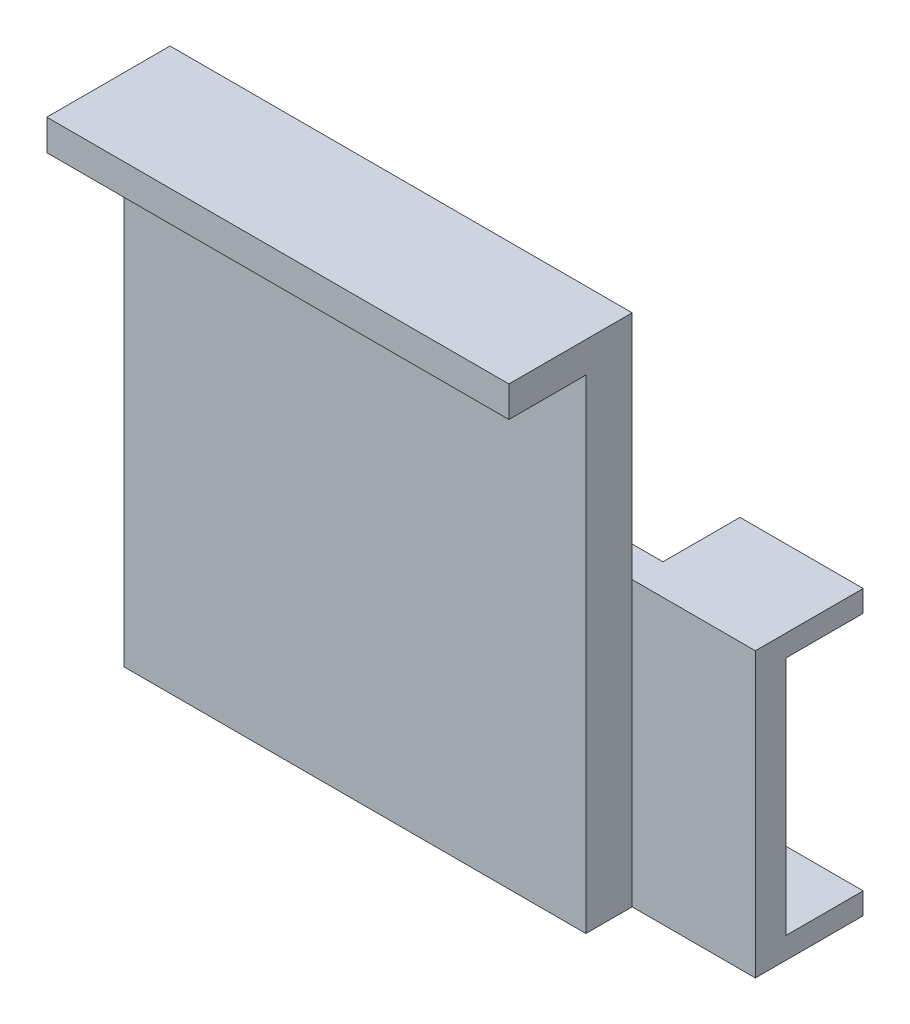
ISO-10303-21;
HEADER;
FILE_DESCRIPTION(('STEP AP214'),'2;1');
FILE_NAME('part.step','',(''),(''),'','','');
FILE_SCHEMA(('AUTOMOTIVE_DESIGN { 1 0 10303 214 1 1 1 1 }'));
ENDSEC;
DATA;
#1=APPLICATION_CONTEXT('core data for automotive mechanical design processes');
#2=APPLICATION_PROTOCOL_DEFINITION('international standard','automotive_design',2000,#1);
#3=PRODUCT_CONTEXT('',#1,'mechanical');
#4=PRODUCT('Part','Part','',(#3));
#5=PRODUCT_RELATED_PRODUCT_CATEGORY('part','',(#4));
#6=PRODUCT_DEFINITION_FORMATION('','',#4);
#7=PRODUCT_DEFINITION_CONTEXT('part definition',#1,'design');
#8=PRODUCT_DEFINITION('design','',#6,#7);
#9=PRODUCT_DEFINITION_SHAPE('','',#8);
#10=(LENGTH_UNIT() NAMED_UNIT(*) SI_UNIT(.MILLI.,.METRE.));
#11=(NAMED_UNIT(*) PLANE_ANGLE_UNIT() SI_UNIT($,.RADIAN.));
#12=(NAMED_UNIT(*) SI_UNIT($,.STERADIAN.) SOLID_ANGLE_UNIT());
#13=UNCERTAINTY_MEASURE_WITH_UNIT(LENGTH_MEASURE(1.E-05),#10,'distance_accuracy_value','');
#14=(GEOMETRIC_REPRESENTATION_CONTEXT(3) GLOBAL_UNCERTAINTY_ASSIGNED_CONTEXT((#13)) GLOBAL_UNIT_ASSIGNED_CONTEXT((#10,
#11,#12)) REPRESENTATION_CONTEXT('',''));
#15=CARTESIAN_POINT('',(0.,0.,0.));
#16=DIRECTION('',(0.,0.,1.));
#17=DIRECTION('',(1.,0.,0.));
#18=AXIS2_PLACEMENT_3D('',#15,#16,#17);
#19=CARTESIAN_POINT('',(0.0862789967610667,-0.155598995100074,-21.5362478116436));
#20=DIRECTION('',(0.,0.,-1.));
#21=DIRECTION('',(1.,0.,0.));
#22=AXIS2_PLACEMENT_3D('',#19,#20,#21);
#23=PLANE('',#22);
#24=DIRECTION('',(-1.,0.,0.));
#25=VECTOR('',#24,1.);
#26=CARTESIAN_POINT('',(13.0402789967611,28.6022810048999,-21.5362478116436));
#27=LINE('',#26,#25);
#28=CARTESIAN_POINT('',(13.0402789967611,28.6022810048999,-21.5362478116436));
#29=VERTEX_POINT('',#28);
#30=CARTESIAN_POINT('',(-25.8217210032389,28.6022810048999,-21.5362478116436));
#31=VERTEX_POINT('',#30);
#32=EDGE_CURVE('E164',#29,#31,#27,.T.);
#33=ORIENTED_EDGE('',*,*,#32,.T.);
#34=DIRECTION('',(0.,1.,0.));
#35=VECTOR('',#34,1.);
#36=CARTESIAN_POINT('',(-25.8217210032389,11.7620810048999,-21.5362478116436));
#37=LINE('',#36,#35);
#38=CARTESIAN_POINT('',(-25.8217210032389,-12.0732789951001,-21.5362478116436));
#39=VERTEX_POINT('',#38);
#40=EDGE_CURVE('E178',#39,#31,#37,.T.);
#41=ORIENTED_EDGE('',*,*,#40,.F.);
#42=DIRECTION('',(-1.,0.,0.));
#43=VECTOR('',#42,1.);
#44=CARTESIAN_POINT('',(-25.8217210032389,-12.0732789951001,-21.5362478116436));
#45=LINE('',#44,#43);
#46=CARTESIAN_POINT('',(13.0402789967611,-12.0732789951001,-21.5362478116436));
#47=VERTEX_POINT('',#46);
#48=EDGE_CURVE('E184',#47,#39,#45,.T.);
#49=ORIENTED_EDGE('',*,*,#48,.F.);
#50=DIRECTION('',(0.,-1.,0.));
#51=VECTOR('',#50,1.);
#52=CARTESIAN_POINT('',(13.0402789967611,11.7620810048999,-21.5362478116436));
#53=LINE('',#52,#51);
#54=EDGE_CURVE('E181',#29,#47,#53,.T.);
#55=ORIENTED_EDGE('',*,*,#54,.F.);
#56=EDGE_LOOP('',(#33,#41,#49,#55));
#57=FACE_BOUND('',#56,.T.);
#58=ADVANCED_FACE('F39',(#57),#23,.F.);
#59=CARTESIAN_POINT('',(0.0862789967610667,-0.155598995100074,-28.0132478116435));
#60=DIRECTION('',(0.,0.,1.));
#61=DIRECTION('',(-1.,0.,0.));
#62=AXIS2_PLACEMENT_3D('',#59,#60,#61);
#63=PLANE('',#62);
#64=DIRECTION('',(-1.,0.,0.));
#65=VECTOR('',#64,1.);
#66=CARTESIAN_POINT('',(25.9942789967611,-10.2597189951001,-28.0132478116435));
#67=LINE('',#66,#65);
#68=CARTESIAN_POINT('',(23.4034789967611,-10.2597189951001,-28.0132478116435));
#69=VERTEX_POINT('',#68);
#70=CARTESIAN_POINT('',(13.0402789967611,-10.2597189951001,-28.0132478116435));
#71=VERTEX_POINT('',#70);
#72=EDGE_CURVE('E216',#69,#71,#67,.T.);
#73=ORIENTED_EDGE('',*,*,#72,.T.);
#74=DIRECTION('',(0.,-1.,0.));
#75=VECTOR('',#74,1.);
#76=CARTESIAN_POINT('',(13.0402789967611,-12.0732789951001,-28.0132478116435));
#77=LINE('',#76,#75);
#78=CARTESIAN_POINT('',(13.0402789967611,-12.0732789951001,-28.0132478116435));
#79=VERTEX_POINT('',#78);
#80=EDGE_CURVE('E221',#71,#79,#77,.T.);
#81=ORIENTED_EDGE('',*,*,#80,.T.);
#82=DIRECTION('',(1.,0.,0.));
#83=VECTOR('',#82,1.);
#84=CARTESIAN_POINT('',(-25.8217210032389,-12.0732789951001,-28.0132478116435));
#85=LINE('',#84,#83);
#86=CARTESIAN_POINT('',(-25.8217210032389,-12.0732789951001,-28.0132478116435));
#87=VERTEX_POINT('',#86);
#88=EDGE_CURVE('E261',#87,#79,#85,.T.);
#89=ORIENTED_EDGE('',*,*,#88,.F.);
#90=DIRECTION('',(0.,-1.,0.));
#91=VECTOR('',#90,1.);
#92=CARTESIAN_POINT('',(-25.8217210032389,-12.0732789951001,-28.0132478116435));
#93=LINE('',#92,#91);
#94=CARTESIAN_POINT('',(-25.8217210032389,11.7620810048999,-28.0132478116435));
#95=VERTEX_POINT('',#94);
#96=EDGE_CURVE('E257',#95,#87,#93,.T.);
#97=ORIENTED_EDGE('',*,*,#96,.F.);
#98=DIRECTION('',(-1.,0.,0.));
#99=VECTOR('',#98,1.);
#100=CARTESIAN_POINT('',(-25.8217210032389,11.7620810048999,-28.0132478116435));
#101=LINE('',#100,#99);
#102=CARTESIAN_POINT('',(13.0402789967611,11.7620810048999,-28.0132478116435));
#103=VERTEX_POINT('',#102);
#104=EDGE_CURVE('E254',#103,#95,#101,.T.);
#105=ORIENTED_EDGE('',*,*,#104,.F.);
#106=DIRECTION('',(0.,-1.,0.));
#107=VECTOR('',#106,1.);
#108=CARTESIAN_POINT('',(13.0402789967611,11.7620810048999,-28.0132478116435));
#109=LINE('',#108,#107);
#110=CARTESIAN_POINT('',(13.0402789967611,9.94852100489993,-28.0132478116435));
#111=VERTEX_POINT('',#110);
#112=EDGE_CURVE('E234',#103,#111,#109,.T.);
#113=ORIENTED_EDGE('',*,*,#112,.T.);
#114=DIRECTION('',(1.,0.,0.));
#115=VECTOR('',#114,1.);
#116=CARTESIAN_POINT('',(25.9942789967611,9.94852100489993,-28.0132478116435));
#117=LINE('',#116,#115);
#118=CARTESIAN_POINT('',(23.4034789967611,9.94852100489993,-28.0132478116435));
#119=VERTEX_POINT('',#118);
#120=EDGE_CURVE('E239',#111,#119,#117,.T.);
#121=ORIENTED_EDGE('',*,*,#120,.T.);
#122=DIRECTION('',(0.,1.,0.));
#123=VECTOR('',#122,1.);
#124=CARTESIAN_POINT('',(23.4034789967611,-0.155598995100074,-28.0132478116435));
#125=LINE('',#124,#123);
#126=EDGE_CURVE('E210',#69,#119,#125,.T.);
#127=ORIENTED_EDGE('',*,*,#126,.F.);
#128=EDGE_LOOP('',(#73,#81,#89,#97,#105,#113,#121,#127));
#129=FACE_BOUND('',#128,.T.);
#130=ADVANCED_FACE('F296',(#129),#63,.F.);
#131=CARTESIAN_POINT('',(-25.8217210032389,11.7620810048999,-28.0132478116435));
#132=DIRECTION('',(0.,-1.,0.));
#133=DIRECTION('',(0.,0.,1.));
#134=AXIS2_PLACEMENT_3D('',#131,#132,#133);
#135=PLANE('',#134);
#136=DIRECTION('',(-1.,0.,0.));
#137=VECTOR('',#136,1.);
#138=CARTESIAN_POINT('',(25.9942789967611,11.7620810048999,-34.4902478116436));
#139=LINE('',#138,#137);
#140=CARTESIAN_POINT('',(23.4034789967611,11.7620810048999,-34.4902478116436));
#141=VERTEX_POINT('',#140);
#142=CARTESIAN_POINT('',(13.0402789967611,11.7620810048999,-34.4902478116436));
#143=VERTEX_POINT('',#142);
#144=EDGE_CURVE('E235',#141,#143,#139,.T.);
#145=ORIENTED_EDGE('',*,*,#144,.T.);
#146=DIRECTION('',(0.,0.,1.));
#147=VECTOR('',#146,1.);
#148=CARTESIAN_POINT('',(13.0402789967611,11.7620810048999,-34.4902478116436));
#149=LINE('',#148,#147);
#150=EDGE_CURVE('E251',#143,#103,#149,.T.);
#151=ORIENTED_EDGE('',*,*,#150,.T.);
#152=ORIENTED_EDGE('',*,*,#104,.T.);
#153=DIRECTION('',(0.,0.,1.));
#154=VECTOR('',#153,1.);
#155=CARTESIAN_POINT('',(-25.8217210032389,11.7620810048999,-28.0132478116435));
#156=LINE('',#155,#154);
#157=CARTESIAN_POINT('',(-25.8217210032389,11.7620810048999,-25.4224478116436));
#158=VERTEX_POINT('',#157);
#159=EDGE_CURVE('E43',#95,#158,#156,.T.);
#160=ORIENTED_EDGE('',*,*,#159,.T.);
#161=DIRECTION('',(-1.,0.,0.));
#162=VECTOR('',#161,1.);
#163=CARTESIAN_POINT('',(-25.8217210032389,11.7620810048999,-25.4224478116436));
#164=LINE('',#163,#162);
#165=CARTESIAN_POINT('',(13.0402789967611,11.7620810048999,-25.4224478116436));
#166=VERTEX_POINT('',#165);
#167=EDGE_CURVE('E253',#166,#158,#164,.T.);
#168=ORIENTED_EDGE('',*,*,#167,.F.);
#169=CARTESIAN_POINT('',(23.4034789967611,11.7620810048999,-25.4224478116436));
#170=VERTEX_POINT('',#169);
#171=EDGE_CURVE('E265',#170,#166,#164,.T.);
#172=ORIENTED_EDGE('',*,*,#171,.F.);
#173=DIRECTION('',(0.,0.,-1.));
#174=VECTOR('',#173,1.);
#175=CARTESIAN_POINT('',(23.4034789967611,11.7620810048999,-34.4902478116436));
#176=LINE('',#175,#174);
#177=EDGE_CURVE('E197',#170,#141,#176,.T.);
#178=ORIENTED_EDGE('',*,*,#177,.T.);
#179=EDGE_LOOP('',(#145,#151,#152,#160,#168,#172,#178));
#180=FACE_BOUND('',#179,.T.);
#181=ADVANCED_FACE('F41',(#180),#135,.F.);
#182=CARTESIAN_POINT('',(-25.8217210032389,-12.0732789951001,-28.0132478116435));
#183=DIRECTION('',(1.,0.,0.));
#184=DIRECTION('',(0.,0.,1.));
#185=AXIS2_PLACEMENT_3D('',#182,#183,#184);
#186=PLANE('',#185);
#187=ORIENTED_EDGE('',*,*,#159,.F.);
#188=ORIENTED_EDGE('',*,*,#96,.T.);
#189=DIRECTION('',(0.,0.,1.));
#190=VECTOR('',#189,1.);
#191=CARTESIAN_POINT('',(-25.8217210032389,-12.0732789951001,-28.0132478116435));
#192=LINE('',#191,#190);
#193=EDGE_CURVE('E264',#87,#39,#192,.T.);
#194=ORIENTED_EDGE('',*,*,#193,.T.);
#195=ORIENTED_EDGE('',*,*,#40,.T.);
#196=DIRECTION('',(0.,0.,-1.));
#197=VECTOR('',#196,1.);
#198=CARTESIAN_POINT('',(-25.8217210032389,28.6022810048999,-15.0592478116435));
#199=LINE('',#198,#197);
#200=CARTESIAN_POINT('',(-25.8217210032389,28.6022810048999,-15.0592478116435));
#201=VERTEX_POINT('',#200);
#202=EDGE_CURVE('E166',#201,#31,#199,.T.);
#203=ORIENTED_EDGE('',*,*,#202,.F.);
#204=DIRECTION('',(0.,1.,0.));
#205=VECTOR('',#204,1.);
#206=CARTESIAN_POINT('',(-25.8217210032389,31.1930810048999,-15.0592478116435));
#207=LINE('',#206,#205);
#208=CARTESIAN_POINT('',(-25.8217210032389,31.1930810048999,-15.0592478116435));
#209=VERTEX_POINT('',#208);
#210=EDGE_CURVE('E157',#201,#209,#207,.T.);
#211=ORIENTED_EDGE('',*,*,#210,.T.);
#212=DIRECTION('',(0.,0.,-1.));
#213=VECTOR('',#212,1.);
#214=CARTESIAN_POINT('',(-25.8217210032389,31.1930810048999,-21.5362478116436));
#215=LINE('',#214,#213);
#216=CARTESIAN_POINT('',(-25.8217210032389,31.1930810048999,-25.4224478116436));
#217=VERTEX_POINT('',#216);
#218=EDGE_CURVE('E194',#209,#217,#215,.T.);
#219=ORIENTED_EDGE('',*,*,#218,.T.);
#220=DIRECTION('',(0.,1.,0.));
#221=VECTOR('',#220,1.);
#222=CARTESIAN_POINT('',(-25.8217210032389,11.7620810048999,-25.4224478116436));
#223=LINE('',#222,#221);
#224=EDGE_CURVE('E182',#158,#217,#223,.T.);
#225=ORIENTED_EDGE('',*,*,#224,.F.);
#226=EDGE_LOOP('',(#187,#188,#194,#195,#203,#211,#219,#225));
#227=FACE_BOUND('',#226,.T.);
#228=ADVANCED_FACE('F276',(#227),#186,.F.);
#229=CARTESIAN_POINT('',(-25.8217210032389,-12.0732789951001,-28.0132478116435));
#230=DIRECTION('',(0.,1.,0.));
#231=DIRECTION('',(0.,0.,-1.));
#232=AXIS2_PLACEMENT_3D('',#229,#230,#231);
#233=PLANE('',#232);
#234=ORIENTED_EDGE('',*,*,#193,.F.);
#235=ORIENTED_EDGE('',*,*,#88,.T.);
#236=DIRECTION('',(0.,0.,1.));
#237=VECTOR('',#236,1.);
#238=CARTESIAN_POINT('',(13.0402789967611,-12.0732789951001,-34.4902478116436));
#239=LINE('',#238,#237);
#240=CARTESIAN_POINT('',(13.0402789967611,-12.0732789951001,-34.4902478116436));
#241=VERTEX_POINT('',#240);
#242=EDGE_CURVE('E226',#241,#79,#239,.T.);
#243=ORIENTED_EDGE('',*,*,#242,.F.);
#244=DIRECTION('',(1.,0.,0.));
#245=VECTOR('',#244,1.);
#246=CARTESIAN_POINT('',(25.9942789967611,-12.0732789951001,-34.4902478116436));
#247=LINE('',#246,#245);
#248=CARTESIAN_POINT('',(23.4034789967611,-12.0732789951001,-34.4902478116436));
#249=VERTEX_POINT('',#248);
#250=EDGE_CURVE('E223',#241,#249,#247,.T.);
#251=ORIENTED_EDGE('',*,*,#250,.T.);
#252=DIRECTION('',(0.,0.,-1.));
#253=VECTOR('',#252,1.);
#254=CARTESIAN_POINT('',(23.4034789967611,-12.0732789951001,-34.4902478116436));
#255=LINE('',#254,#253);
#256=CARTESIAN_POINT('',(23.4034789967611,-12.0732789951001,-25.4224478116436));
#257=VERTEX_POINT('',#256);
#258=EDGE_CURVE('E198',#257,#249,#255,.T.);
#259=ORIENTED_EDGE('',*,*,#258,.F.);
#260=DIRECTION('',(1.,0.,0.));
#261=VECTOR('',#260,1.);
#262=CARTESIAN_POINT('',(-25.8217210032389,-12.0732789951001,-25.4224478116436));
#263=LINE('',#262,#261);
#264=CARTESIAN_POINT('',(13.0402789967611,-12.0732789951001,-25.4224478116436));
#265=VERTEX_POINT('',#264);
#266=EDGE_CURVE('E258',#265,#257,#263,.T.);
#267=ORIENTED_EDGE('',*,*,#266,.F.);
#268=DIRECTION('',(0.,0.,-1.));
#269=VECTOR('',#268,1.);
#270=CARTESIAN_POINT('',(13.0402789967611,-12.0732789951001,-21.5362478116436));
#271=LINE('',#270,#269);
#272=EDGE_CURVE('E187',#47,#265,#271,.T.);
#273=ORIENTED_EDGE('',*,*,#272,.F.);
#274=ORIENTED_EDGE('',*,*,#48,.T.);
#275=EDGE_LOOP('',(#234,#235,#243,#251,#259,#267,#273,#274));
#276=FACE_BOUND('',#275,.T.);
#277=ADVANCED_FACE('F409',(#276),#233,.F.);
#278=CARTESIAN_POINT('',(0.0862789967610667,-0.155598995100074,-25.4224478116436));
#279=DIRECTION('',(0.,0.,1.));
#280=DIRECTION('',(-1.,0.,0.));
#281=AXIS2_PLACEMENT_3D('',#278,#279,#280);
#282=PLANE('',#281);
#283=DIRECTION('',(0.,-1.,0.));
#284=VECTOR('',#283,1.);
#285=CARTESIAN_POINT('',(13.0402789967611,11.7620810048999,-25.4224478116436));
#286=LINE('',#285,#284);
#287=EDGE_CURVE('E11',#166,#265,#286,.T.);
#288=ORIENTED_EDGE('',*,*,#287,.T.);
#289=ORIENTED_EDGE('',*,*,#266,.T.);
#290=DIRECTION('',(0.,1.,0.));
#291=VECTOR('',#290,1.);
#292=CARTESIAN_POINT('',(23.4034789967611,-12.0732789951001,-25.4224478116436));
#293=LINE('',#292,#291);
#294=EDGE_CURVE('E201',#257,#170,#293,.T.);
#295=ORIENTED_EDGE('',*,*,#294,.T.);
#296=ORIENTED_EDGE('',*,*,#171,.T.);
#297=EDGE_LOOP('',(#288,#289,#295,#296));
#298=FACE_BOUND('',#297,.T.);
#299=ADVANCED_FACE('F400',(#298),#282,.T.);
#300=CARTESIAN_POINT('',(13.0402789967611,11.7620810048999,-34.4902478116436));
#301=DIRECTION('',(1.,0.,0.));
#302=DIRECTION('',(0.,0.,1.));
#303=AXIS2_PLACEMENT_3D('',#300,#301,#302);
#304=PLANE('',#303);
#305=ORIENTED_EDGE('',*,*,#112,.F.);
#306=ORIENTED_EDGE('',*,*,#150,.F.);
#307=DIRECTION('',(0.,-1.,0.));
#308=VECTOR('',#307,1.);
#309=CARTESIAN_POINT('',(13.0402789967611,11.7620810048999,-34.4902478116436));
#310=LINE('',#309,#308);
#311=CARTESIAN_POINT('',(13.0402789967611,9.94852100489993,-34.4902478116436));
#312=VERTEX_POINT('',#311);
#313=EDGE_CURVE('E238',#143,#312,#310,.T.);
#314=ORIENTED_EDGE('',*,*,#313,.T.);
#315=DIRECTION('',(0.,0.,1.));
#316=VECTOR('',#315,1.);
#317=CARTESIAN_POINT('',(13.0402789967611,9.94852100489993,-34.4902478116436));
#318=LINE('',#317,#316);
#319=EDGE_CURVE('E245',#312,#111,#318,.T.);
#320=ORIENTED_EDGE('',*,*,#319,.T.);
#321=EDGE_LOOP('',(#305,#306,#314,#320));
#322=FACE_BOUND('',#321,.T.);
#323=ADVANCED_FACE('F391',(#322),#304,.F.);
#324=CARTESIAN_POINT('',(25.9942789967611,9.94852100489993,-34.4902478116436));
#325=DIRECTION('',(0.,1.,0.));
#326=DIRECTION('',(-1.,0.,0.));
#327=AXIS2_PLACEMENT_3D('',#324,#325,#326);
#328=PLANE('',#327);
#329=ORIENTED_EDGE('',*,*,#120,.F.);
#330=ORIENTED_EDGE('',*,*,#319,.F.);
#331=DIRECTION('',(1.,0.,0.));
#332=VECTOR('',#331,1.);
#333=CARTESIAN_POINT('',(25.9942789967611,9.94852100489993,-34.4902478116436));
#334=LINE('',#333,#332);
#335=CARTESIAN_POINT('',(23.4034789967611,9.94852100489993,-34.4902478116436));
#336=VERTEX_POINT('',#335);
#337=EDGE_CURVE('E242',#312,#336,#334,.T.);
#338=ORIENTED_EDGE('',*,*,#337,.T.);
#339=DIRECTION('',(0.,0.,-1.));
#340=VECTOR('',#339,1.);
#341=CARTESIAN_POINT('',(23.4034789967611,9.94852100489993,-34.4902478116436));
#342=LINE('',#341,#340);
#343=EDGE_CURVE('E213',#119,#336,#342,.T.);
#344=ORIENTED_EDGE('',*,*,#343,.F.);
#345=EDGE_LOOP('',(#329,#330,#338,#344));
#346=FACE_BOUND('',#345,.T.);
#347=ADVANCED_FACE('F382',(#346),#328,.F.);
#348=CARTESIAN_POINT('',(0.0862789967610667,-0.155598995100074,-34.4902478116436));
#349=DIRECTION('',(0.,0.,1.));
#350=DIRECTION('',(-1.,0.,0.));
#351=AXIS2_PLACEMENT_3D('',#348,#349,#350);
#352=PLANE('',#351);
#353=ORIENTED_EDGE('',*,*,#337,.F.);
#354=ORIENTED_EDGE('',*,*,#313,.F.);
#355=ORIENTED_EDGE('',*,*,#144,.F.);
#356=DIRECTION('',(0.,1.,0.));
#357=VECTOR('',#356,1.);
#358=CARTESIAN_POINT('',(23.4034789967611,-12.0732789951001,-34.4902478116436));
#359=LINE('',#358,#357);
#360=EDGE_CURVE('E207',#336,#141,#359,.T.);
#361=ORIENTED_EDGE('',*,*,#360,.F.);
#362=EDGE_LOOP('',(#353,#354,#355,#361));
#363=FACE_BOUND('',#362,.T.);
#364=ADVANCED_FACE('F373',(#363),#352,.F.);
#365=CARTESIAN_POINT('',(25.9942789967611,-10.2597189951001,-34.4902478116436));
#366=DIRECTION('',(0.,-1.,0.));
#367=DIRECTION('',(1.,0.,0.));
#368=AXIS2_PLACEMENT_3D('',#365,#366,#367);
#369=PLANE('',#368);
#370=DIRECTION('',(-1.,0.,0.));
#371=VECTOR('',#370,1.);
#372=CARTESIAN_POINT('',(25.9942789967611,-10.2597189951001,-34.4902478116436));
#373=LINE('',#372,#371);
#374=CARTESIAN_POINT('',(23.4034789967611,-10.2597189951001,-34.4902478116436));
#375=VERTEX_POINT('',#374);
#376=CARTESIAN_POINT('',(13.0402789967611,-10.2597189951001,-34.4902478116436));
#377=VERTEX_POINT('',#376);
#378=EDGE_CURVE('E217',#375,#377,#373,.T.);
#379=ORIENTED_EDGE('',*,*,#378,.T.);
#380=DIRECTION('',(0.,0.,1.));
#381=VECTOR('',#380,1.);
#382=CARTESIAN_POINT('',(13.0402789967611,-10.2597189951001,-34.4902478116436));
#383=LINE('',#382,#381);
#384=EDGE_CURVE('E232',#377,#71,#383,.T.);
#385=ORIENTED_EDGE('',*,*,#384,.T.);
#386=ORIENTED_EDGE('',*,*,#72,.F.);
#387=DIRECTION('',(0.,0.,1.));
#388=VECTOR('',#387,1.);
#389=CARTESIAN_POINT('',(23.4034789967611,-10.2597189951001,-34.4902478116436));
#390=LINE('',#389,#388);
#391=EDGE_CURVE('E206',#375,#69,#390,.T.);
#392=ORIENTED_EDGE('',*,*,#391,.F.);
#393=EDGE_LOOP('',(#379,#385,#386,#392));
#394=FACE_BOUND('',#393,.T.);
#395=ADVANCED_FACE('F364',(#394),#369,.F.);
#396=CARTESIAN_POINT('',(13.0402789967611,-12.0732789951001,-34.4902478116436));
#397=DIRECTION('',(1.,0.,0.));
#398=DIRECTION('',(0.,1.,0.));
#399=AXIS2_PLACEMENT_3D('',#396,#397,#398);
#400=PLANE('',#399);
#401=ORIENTED_EDGE('',*,*,#80,.F.);
#402=ORIENTED_EDGE('',*,*,#384,.F.);
#403=DIRECTION('',(0.,-1.,0.));
#404=VECTOR('',#403,1.);
#405=CARTESIAN_POINT('',(13.0402789967611,-12.0732789951001,-34.4902478116436));
#406=LINE('',#405,#404);
#407=EDGE_CURVE('E220',#377,#241,#406,.T.);
#408=ORIENTED_EDGE('',*,*,#407,.T.);
#409=ORIENTED_EDGE('',*,*,#242,.T.);
#410=EDGE_LOOP('',(#401,#402,#408,#409));
#411=FACE_BOUND('',#410,.T.);
#412=ADVANCED_FACE('F355',(#411),#400,.F.);
#413=CARTESIAN_POINT('',(0.0862789967610667,-0.155598995100074,-34.4902478116436));
#414=DIRECTION('',(0.,0.,-1.));
#415=DIRECTION('',(1.,0.,0.));
#416=AXIS2_PLACEMENT_3D('',#413,#414,#415);
#417=PLANE('',#416);
#418=EDGE_CURVE('E204',#249,#375,#359,.T.);
#419=ORIENTED_EDGE('',*,*,#418,.F.);
#420=ORIENTED_EDGE('',*,*,#250,.F.);
#421=ORIENTED_EDGE('',*,*,#407,.F.);
#422=ORIENTED_EDGE('',*,*,#378,.F.);
#423=EDGE_LOOP('',(#419,#420,#421,#422));
#424=FACE_BOUND('',#423,.T.);
#425=ADVANCED_FACE('F290',(#424),#417,.T.);
#426=CARTESIAN_POINT('',(23.4034789967611,-12.0732789951001,-34.4902478116436));
#427=DIRECTION('',(-1.,0.,0.));
#428=DIRECTION('',(0.,0.,-1.));
#429=AXIS2_PLACEMENT_3D('',#426,#427,#428);
#430=PLANE('',#429);
#431=ORIENTED_EDGE('',*,*,#126,.T.);
#432=ORIENTED_EDGE('',*,*,#343,.T.);
#433=ORIENTED_EDGE('',*,*,#360,.T.);
#434=ORIENTED_EDGE('',*,*,#177,.F.);
#435=ORIENTED_EDGE('',*,*,#294,.F.);
#436=ORIENTED_EDGE('',*,*,#258,.T.);
#437=ORIENTED_EDGE('',*,*,#418,.T.);
#438=ORIENTED_EDGE('',*,*,#391,.T.);
#439=EDGE_LOOP('',(#431,#432,#433,#434,#435,#436,#437,#438));
#440=FACE_BOUND('',#439,.T.);
#441=ADVANCED_FACE('F282',(#440),#430,.F.);
#442=CARTESIAN_POINT('',(0.0862789967610667,-0.155598995100074,-25.4224478116436));
#443=DIRECTION('',(0.,0.,-1.));
#444=DIRECTION('',(1.,0.,0.));
#445=AXIS2_PLACEMENT_3D('',#442,#443,#444);
#446=PLANE('',#445);
#447=ORIENTED_EDGE('',*,*,#167,.T.);
#448=ORIENTED_EDGE('',*,*,#224,.T.);
#449=DIRECTION('',(1.,0.,0.));
#450=VECTOR('',#449,1.);
#451=CARTESIAN_POINT('',(13.0402789967611,31.1930810048999,-25.4224478116436));
#452=LINE('',#451,#450);
#453=CARTESIAN_POINT('',(13.0402789967611,31.1930810048999,-25.4224478116436));
#454=VERTEX_POINT('',#453);
#455=EDGE_CURVE('E165',#217,#454,#452,.T.);
#456=ORIENTED_EDGE('',*,*,#455,.T.);
#457=EDGE_CURVE('E49',#454,#166,#286,.T.);
#458=ORIENTED_EDGE('',*,*,#457,.T.);
#459=EDGE_LOOP('',(#447,#448,#456,#458));
#460=FACE_BOUND('',#459,.T.);
#461=ADVANCED_FACE('F279',(#460),#446,.T.);
#462=CARTESIAN_POINT('',(13.0402789967611,31.1930810048999,-21.5362478116436));
#463=DIRECTION('',(0.,-1.,0.));
#464=DIRECTION('',(0.,0.,1.));
#465=AXIS2_PLACEMENT_3D('',#462,#463,#464);
#466=PLANE('',#465);
#467=ORIENTED_EDGE('',*,*,#455,.F.);
#468=ORIENTED_EDGE('',*,*,#218,.F.);
#469=DIRECTION('',(1.,0.,0.));
#470=VECTOR('',#469,1.);
#471=CARTESIAN_POINT('',(13.0402789967611,31.1930810048999,-15.0592478116435));
#472=LINE('',#471,#470);
#473=CARTESIAN_POINT('',(13.0402789967611,31.1930810048999,-15.0592478116435));
#474=VERTEX_POINT('',#473);
#475=EDGE_CURVE('E175',#209,#474,#472,.T.);
#476=ORIENTED_EDGE('',*,*,#475,.T.);
#477=DIRECTION('',(0.,0.,-1.));
#478=VECTOR('',#477,1.);
#479=CARTESIAN_POINT('',(13.0402789967611,31.1930810048999,-21.5362478116436));
#480=LINE('',#479,#478);
#481=EDGE_CURVE('E169',#474,#454,#480,.T.);
#482=ORIENTED_EDGE('',*,*,#481,.T.);
#483=EDGE_LOOP('',(#467,#468,#476,#482));
#484=FACE_BOUND('',#483,.T.);
#485=ADVANCED_FACE('F281',(#484),#466,.F.);
#486=CARTESIAN_POINT('',(13.0402789967611,11.7620810048999,-21.5362478116436));
#487=DIRECTION('',(-1.,0.,0.));
#488=DIRECTION('',(0.,-1.,0.));
#489=AXIS2_PLACEMENT_3D('',#486,#487,#488);
#490=PLANE('',#489);
#491=ORIENTED_EDGE('',*,*,#457,.F.);
#492=ORIENTED_EDGE('',*,*,#481,.F.);
#493=DIRECTION('',(0.,-1.,0.));
#494=VECTOR('',#493,1.);
#495=CARTESIAN_POINT('',(13.0402789967611,31.1930810048999,-15.0592478116435));
#496=LINE('',#495,#494);
#497=CARTESIAN_POINT('',(13.0402789967611,28.6022810048999,-15.0592478116435));
#498=VERTEX_POINT('',#497);
#499=EDGE_CURVE('E154',#474,#498,#496,.T.);
#500=ORIENTED_EDGE('',*,*,#499,.T.);
#501=DIRECTION('',(0.,0.,-1.));
#502=VECTOR('',#501,1.);
#503=CARTESIAN_POINT('',(13.0402789967611,28.6022810048999,-15.0592478116435));
#504=LINE('',#503,#502);
#505=EDGE_CURVE('E56',#498,#29,#504,.T.);
#506=ORIENTED_EDGE('',*,*,#505,.T.);
#507=ORIENTED_EDGE('',*,*,#54,.T.);
#508=ORIENTED_EDGE('',*,*,#272,.T.);
#509=ORIENTED_EDGE('',*,*,#287,.F.);
#510=EDGE_LOOP('',(#491,#492,#500,#506,#507,#508,#509));
#511=FACE_BOUND('',#510,.T.);
#512=ADVANCED_FACE('F168',(#511),#490,.F.);
#513=CARTESIAN_POINT('',(13.0402789967611,28.6022810048999,-15.0592478116435));
#514=DIRECTION('',(0.,1.,0.));
#515=DIRECTION('',(0.,0.,-1.));
#516=AXIS2_PLACEMENT_3D('',#513,#514,#515);
#517=PLANE('',#516);
#518=ORIENTED_EDGE('',*,*,#32,.F.);
#519=ORIENTED_EDGE('',*,*,#505,.F.);
#520=DIRECTION('',(-1.,0.,0.));
#521=VECTOR('',#520,1.);
#522=CARTESIAN_POINT('',(13.0402789967611,28.6022810048999,-15.0592478116435));
#523=LINE('',#522,#521);
#524=EDGE_CURVE('E152',#498,#201,#523,.T.);
#525=ORIENTED_EDGE('',*,*,#524,.T.);
#526=ORIENTED_EDGE('',*,*,#202,.T.);
#527=EDGE_LOOP('',(#518,#519,#525,#526));
#528=FACE_BOUND('',#527,.T.);
#529=ADVANCED_FACE('F162',(#528),#517,.F.);
#530=CARTESIAN_POINT('',(0.0862789967610667,-0.155598995100074,-15.0592478116435));
#531=DIRECTION('',(0.,0.,1.));
#532=DIRECTION('',(-1.,0.,0.));
#533=AXIS2_PLACEMENT_3D('',#530,#531,#532);
#534=PLANE('',#533);
#535=ORIENTED_EDGE('',*,*,#499,.F.);
#536=ORIENTED_EDGE('',*,*,#475,.F.);
#537=ORIENTED_EDGE('',*,*,#210,.F.);
#538=ORIENTED_EDGE('',*,*,#524,.F.);
#539=EDGE_LOOP('',(#535,#536,#537,#538));
#540=FACE_BOUND('',#539,.T.);
#541=ADVANCED_FACE('F153',(#540),#534,.T.);
#542=CLOSED_SHELL('',(#58,#130,#181,#228,#277,#299,#323,#347,#364,#395,#412,#425,#441,#461,#485,
#512,#529,#541));
#543=MANIFOLD_SOLID_BREP('B2',#542);
#544=ADVANCED_BREP_SHAPE_REPRESENTATION('',(#18,#543),#14);
#545=SHAPE_DEFINITION_REPRESENTATION(#9,#544);
ENDSEC;
END-ISO-10303-21;
